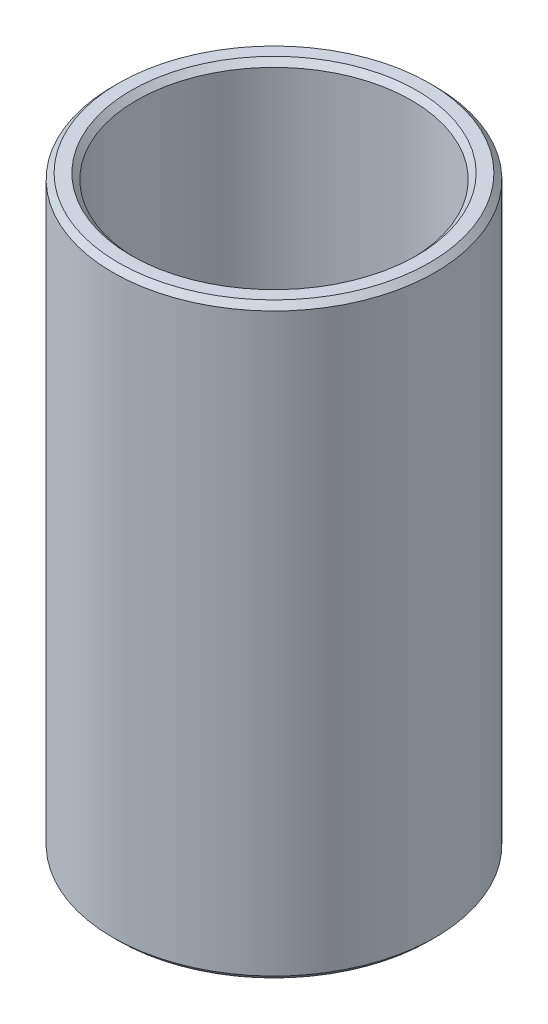
ISO-10303-21;
HEADER;
FILE_DESCRIPTION(('STEP AP214'),'2;1');
FILE_NAME('part.step','',(''),(''),'','','');
FILE_SCHEMA(('AUTOMOTIVE_DESIGN { 1 0 10303 214 1 1 1 1 }'));
ENDSEC;
DATA;
#1=APPLICATION_CONTEXT('core data for automotive mechanical design processes');
#2=APPLICATION_PROTOCOL_DEFINITION('international standard','automotive_design',2000,#1);
#3=PRODUCT_CONTEXT('',#1,'mechanical');
#4=PRODUCT('Part','Part','',(#3));
#5=PRODUCT_RELATED_PRODUCT_CATEGORY('part','',(#4));
#6=PRODUCT_DEFINITION_FORMATION('','',#4);
#7=PRODUCT_DEFINITION_CONTEXT('part definition',#1,'design');
#8=PRODUCT_DEFINITION('design','',#6,#7);
#9=PRODUCT_DEFINITION_SHAPE('','',#8);
#10=(LENGTH_UNIT() NAMED_UNIT(*) SI_UNIT(.MILLI.,.METRE.));
#11=(NAMED_UNIT(*) PLANE_ANGLE_UNIT() SI_UNIT($,.RADIAN.));
#12=(NAMED_UNIT(*) SI_UNIT($,.STERADIAN.) SOLID_ANGLE_UNIT());
#13=UNCERTAINTY_MEASURE_WITH_UNIT(LENGTH_MEASURE(1.E-05),#10,'distance_accuracy_value','');
#14=(GEOMETRIC_REPRESENTATION_CONTEXT(3) GLOBAL_UNCERTAINTY_ASSIGNED_CONTEXT((#13)) GLOBAL_UNIT_ASSIGNED_CONTEXT((#10,
#11,#12)) REPRESENTATION_CONTEXT('',''));
#15=CARTESIAN_POINT('',(0.,0.,0.));
#16=DIRECTION('',(0.,0.,1.));
#17=DIRECTION('',(1.,0.,0.));
#18=AXIS2_PLACEMENT_3D('',#15,#16,#17);
#19=CARTESIAN_POINT('',(0.,127.542226721357,0.));
#20=DIRECTION('',(0.,-1.,0.));
#21=DIRECTION('',(0.,0.,-1.));
#22=AXIS2_PLACEMENT_3D('',#19,#20,#21);
#23=CYLINDRICAL_SURFACE('',#22,35.);
#24=CARTESIAN_POINT('',(0.,1.22053936643632,0.));
#25=DIRECTION('',(0.,1.,0.));
#26=DIRECTION('',(0.,0.,1.));
#27=AXIS2_PLACEMENT_3D('',#24,#25,#26);
#28=CIRCLE('',#27,35.);
#29=CARTESIAN_POINT('',(0.,1.22053936643632,35.));
#30=VERTEX_POINT('',#29);
#31=EDGE_CURVE('E10',#30,#30,#28,.T.);
#32=ORIENTED_EDGE('',*,*,#31,.T.);
#33=EDGE_LOOP('',(#32));
#34=FACE_BOUND('',#33,.T.);
#35=CARTESIAN_POINT('',(0.,126.32168735492,0.));
#36=DIRECTION('',(0.,1.,0.));
#37=DIRECTION('',(0.,0.,1.));
#38=AXIS2_PLACEMENT_3D('',#35,#36,#37);
#39=CIRCLE('',#38,35.);
#40=CARTESIAN_POINT('',(0.,126.32168735492,35.));
#41=VERTEX_POINT('',#40);
#42=EDGE_CURVE('E50',#41,#41,#39,.F.);
#43=ORIENTED_EDGE('',*,*,#42,.T.);
#44=EDGE_LOOP('',(#43));
#45=FACE_BOUND('',#44,.T.);
#46=ADVANCED_FACE('F39',(#34,#45),#23,.T.);
#47=CARTESIAN_POINT('',(0.,127.542226721357,0.));
#48=DIRECTION('',(0.,1.,0.));
#49=DIRECTION('',(0.,0.,1.));
#50=AXIS2_PLACEMENT_3D('',#47,#48,#49);
#51=PLANE('',#50);
#52=CARTESIAN_POINT('',(0.,127.542226721357,0.));
#53=DIRECTION('',(0.,1.,0.));
#54=DIRECTION('',(0.,0.,1.));
#55=AXIS2_PLACEMENT_3D('',#52,#53,#54);
#56=CIRCLE('',#55,31.0484368716779);
#57=CARTESIAN_POINT('',(0.,127.542226721357,31.0484368716779));
#58=VERTEX_POINT('',#57);
#59=EDGE_CURVE('E58',#58,#58,#56,.F.);
#60=ORIENTED_EDGE('',*,*,#59,.T.);
#61=EDGE_LOOP('',(#60));
#62=FACE_BOUND('',#61,.T.);
#63=CARTESIAN_POINT('',(0.,127.542226721357,0.));
#64=DIRECTION('',(0.,1.,0.));
#65=DIRECTION('',(0.,0.,1.));
#66=AXIS2_PLACEMENT_3D('',#63,#64,#65);
#67=CIRCLE('',#66,33.7794606335637);
#68=CARTESIAN_POINT('',(0.,127.542226721357,33.7794606335637));
#69=VERTEX_POINT('',#68);
#70=EDGE_CURVE('E61',#69,#69,#67,.T.);
#71=ORIENTED_EDGE('',*,*,#70,.T.);
#72=EDGE_LOOP('',(#71));
#73=FACE_BOUND('',#72,.T.);
#74=ADVANCED_FACE('F88',(#62,#73),#51,.T.);
#75=CARTESIAN_POINT('',(0.,0.,0.));
#76=DIRECTION('',(0.,1.,0.));
#77=DIRECTION('',(0.,0.,1.));
#78=AXIS2_PLACEMENT_3D('',#75,#76,#77);
#79=PLANE('',#78);
#80=CARTESIAN_POINT('',(0.,0.,0.));
#81=DIRECTION('',(0.,1.,0.));
#82=DIRECTION('',(0.,0.,1.));
#83=AXIS2_PLACEMENT_3D('',#80,#81,#82);
#84=CIRCLE('',#83,31.0484368716779);
#85=CARTESIAN_POINT('',(0.,0.,31.0484368716779));
#86=VERTEX_POINT('',#85);
#87=EDGE_CURVE('E51',#86,#86,#84,.T.);
#88=ORIENTED_EDGE('',*,*,#87,.T.);
#89=EDGE_LOOP('',(#88));
#90=FACE_BOUND('',#89,.T.);
#91=CARTESIAN_POINT('',(0.,0.,0.));
#92=DIRECTION('',(0.,1.,0.));
#93=DIRECTION('',(0.,0.,1.));
#94=AXIS2_PLACEMENT_3D('',#91,#92,#93);
#95=CIRCLE('',#94,33.7794606335637);
#96=CARTESIAN_POINT('',(0.,0.,33.7794606335637));
#97=VERTEX_POINT('',#96);
#98=EDGE_CURVE('E54',#97,#97,#95,.F.);
#99=ORIENTED_EDGE('',*,*,#98,.T.);
#100=EDGE_LOOP('',(#99));
#101=FACE_BOUND('',#100,.T.);
#102=ADVANCED_FACE('F83',(#90,#101),#79,.F.);
#103=CARTESIAN_POINT('',(0.,127.542226721357,0.));
#104=DIRECTION('',(0.,-1.,0.));
#105=DIRECTION('',(0.,0.,-1.));
#106=AXIS2_PLACEMENT_3D('',#103,#104,#105);
#107=CYLINDRICAL_SURFACE('',#106,29.8278975052416);
#108=CARTESIAN_POINT('',(0.,126.32168735492,0.));
#109=DIRECTION('',(0.,1.,0.));
#110=DIRECTION('',(0.,0.,1.));
#111=AXIS2_PLACEMENT_3D('',#108,#109,#110);
#112=CIRCLE('',#111,29.8278975052416);
#113=CARTESIAN_POINT('',(0.,126.32168735492,29.8278975052416));
#114=VERTEX_POINT('',#113);
#115=EDGE_CURVE('E67',#114,#114,#112,.T.);
#116=ORIENTED_EDGE('',*,*,#115,.T.);
#117=EDGE_LOOP('',(#116));
#118=FACE_BOUND('',#117,.T.);
#119=CARTESIAN_POINT('',(0.,1.22053936643632,0.));
#120=DIRECTION('',(0.,1.,0.));
#121=DIRECTION('',(0.,0.,1.));
#122=AXIS2_PLACEMENT_3D('',#119,#120,#121);
#123=CIRCLE('',#122,29.8278975052416);
#124=CARTESIAN_POINT('',(0.,1.22053936643632,29.8278975052416));
#125=VERTEX_POINT('',#124);
#126=EDGE_CURVE('E69',#125,#125,#123,.F.);
#127=ORIENTED_EDGE('',*,*,#126,.T.);
#128=EDGE_LOOP('',(#127));
#129=FACE_BOUND('',#128,.T.);
#130=ADVANCED_FACE('F71',(#118,#129),#107,.F.);
#131=CARTESIAN_POINT('',(0.,126.32168735492,0.));
#132=DIRECTION('',(0.,1.,0.));
#133=DIRECTION('',(0.,0.,1.));
#134=AXIS2_PLACEMENT_3D('',#131,#132,#133);
#135=CONICAL_SURFACE('',#134,29.8278975052416,0.785398163397447);
#136=ORIENTED_EDGE('',*,*,#59,.F.);
#137=EDGE_LOOP('',(#136));
#138=FACE_BOUND('',#137,.T.);
#139=ORIENTED_EDGE('',*,*,#115,.F.);
#140=EDGE_LOOP('',(#139));
#141=FACE_BOUND('',#140,.T.);
#142=ADVANCED_FACE('F77',(#138,#141),#135,.F.);
#143=CARTESIAN_POINT('',(0.,0.,0.));
#144=DIRECTION('',(0.,-1.,0.));
#145=DIRECTION('',(0.,0.,-1.));
#146=AXIS2_PLACEMENT_3D('',#143,#144,#145);
#147=CONICAL_SURFACE('',#146,31.0484368716779,0.785398163397447);
#148=ORIENTED_EDGE('',*,*,#126,.F.);
#149=EDGE_LOOP('',(#148));
#150=FACE_BOUND('',#149,.T.);
#151=ORIENTED_EDGE('',*,*,#87,.F.);
#152=EDGE_LOOP('',(#151));
#153=FACE_BOUND('',#152,.T.);
#154=ADVANCED_FACE('F73',(#150,#153),#147,.F.);
#155=CARTESIAN_POINT('',(0.,1.22053936643632,0.));
#156=DIRECTION('',(0.,1.,0.));
#157=DIRECTION('',(0.,0.,1.));
#158=AXIS2_PLACEMENT_3D('',#155,#156,#157);
#159=CONICAL_SURFACE('',#158,35.,0.785398163397451);
#160=ORIENTED_EDGE('',*,*,#98,.F.);
#161=EDGE_LOOP('',(#160));
#162=FACE_BOUND('',#161,.T.);
#163=ORIENTED_EDGE('',*,*,#31,.F.);
#164=EDGE_LOOP('',(#163));
#165=FACE_BOUND('',#164,.T.);
#166=ADVANCED_FACE('F76',(#162,#165),#159,.T.);
#167=CARTESIAN_POINT('',(0.,127.542226721357,0.));
#168=DIRECTION('',(0.,-1.,0.));
#169=DIRECTION('',(0.,0.,-1.));
#170=AXIS2_PLACEMENT_3D('',#167,#168,#169);
#171=CONICAL_SURFACE('',#170,33.7794606335637,0.785398163397434);
#172=ORIENTED_EDGE('',*,*,#42,.F.);
#173=EDGE_LOOP('',(#172));
#174=FACE_BOUND('',#173,.T.);
#175=ORIENTED_EDGE('',*,*,#70,.F.);
#176=EDGE_LOOP('',(#175));
#177=FACE_BOUND('',#176,.T.);
#178=ADVANCED_FACE('F45',(#174,#177),#171,.T.);
#179=CLOSED_SHELL('',(#46,#74,#102,#130,#142,#154,#166,#178));
#180=MANIFOLD_SOLID_BREP('B2',#179);
#181=ADVANCED_BREP_SHAPE_REPRESENTATION('',(#18,#180),#14);
#182=SHAPE_DEFINITION_REPRESENTATION(#9,#181);
ENDSEC;
END-ISO-10303-21;
